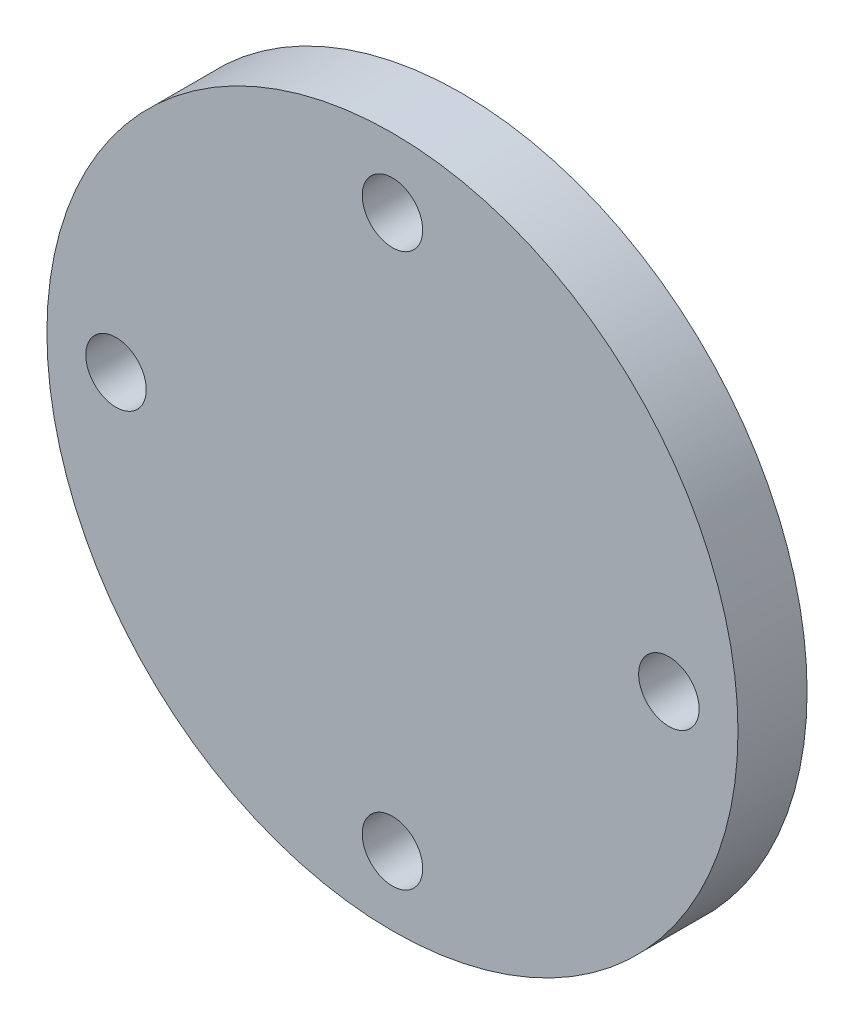
ISO-10303-21;
HEADER;
FILE_DESCRIPTION(('STEP AP214'),'2;1');
FILE_NAME('part.step','',(''),(''),'','','');
FILE_SCHEMA(('AUTOMOTIVE_DESIGN { 1 0 10303 214 1 1 1 1 }'));
ENDSEC;
DATA;
#1=APPLICATION_CONTEXT('core data for automotive mechanical design processes');
#2=APPLICATION_PROTOCOL_DEFINITION('international standard','automotive_design',2000,#1);
#3=PRODUCT_CONTEXT('',#1,'mechanical');
#4=PRODUCT('Part','Part','',(#3));
#5=PRODUCT_RELATED_PRODUCT_CATEGORY('part','',(#4));
#6=PRODUCT_DEFINITION_FORMATION('','',#4);
#7=PRODUCT_DEFINITION_CONTEXT('part definition',#1,'design');
#8=PRODUCT_DEFINITION('design','',#6,#7);
#9=PRODUCT_DEFINITION_SHAPE('','',#8);
#10=(LENGTH_UNIT() NAMED_UNIT(*) SI_UNIT(.MILLI.,.METRE.));
#11=(NAMED_UNIT(*) PLANE_ANGLE_UNIT() SI_UNIT($,.RADIAN.));
#12=(NAMED_UNIT(*) SI_UNIT($,.STERADIAN.) SOLID_ANGLE_UNIT());
#13=UNCERTAINTY_MEASURE_WITH_UNIT(LENGTH_MEASURE(1.E-05),#10,'distance_accuracy_value','');
#14=(GEOMETRIC_REPRESENTATION_CONTEXT(3) GLOBAL_UNCERTAINTY_ASSIGNED_CONTEXT((#13)) GLOBAL_UNIT_ASSIGNED_CONTEXT((#10,
#11,#12)) REPRESENTATION_CONTEXT('',''));
#15=CARTESIAN_POINT('',(0.,0.,0.));
#16=DIRECTION('',(0.,0.,1.));
#17=DIRECTION('',(1.,0.,0.));
#18=AXIS2_PLACEMENT_3D('',#15,#16,#17);
#19=CARTESIAN_POINT('',(0.,0.,0.));
#20=DIRECTION('',(0.,0.,1.));
#21=DIRECTION('',(1.,0.,0.));
#22=AXIS2_PLACEMENT_3D('',#19,#20,#21);
#23=PLANE('',#22);
#24=CARTESIAN_POINT('',(0.,0.,0.));
#25=DIRECTION('',(0.,0.,1.));
#26=DIRECTION('',(1.,0.,0.));
#27=AXIS2_PLACEMENT_3D('',#24,#25,#26);
#28=CIRCLE('',#27,63.5);
#29=CARTESIAN_POINT('',(63.5,0.,0.));
#30=VERTEX_POINT('',#29);
#31=EDGE_CURVE('E52',#30,#30,#28,.T.);
#32=ORIENTED_EDGE('',*,*,#31,.F.);
#33=EDGE_LOOP('',(#32));
#34=FACE_BOUND('',#33,.T.);
#35=CARTESIAN_POINT('',(-50.8,0.,0.));
#36=DIRECTION('',(0.,0.,1.));
#37=DIRECTION('',(1.,0.,0.));
#38=AXIS2_PLACEMENT_3D('',#35,#36,#37);
#39=CIRCLE('',#38,5.55625);
#40=CARTESIAN_POINT('',(-45.24375,0.,0.));
#41=VERTEX_POINT('',#40);
#42=EDGE_CURVE('E146',#41,#41,#39,.T.);
#43=ORIENTED_EDGE('',*,*,#42,.T.);
#44=EDGE_LOOP('',(#43));
#45=FACE_BOUND('',#44,.T.);
#46=CARTESIAN_POINT('',(1.80411241501588E-13,50.8,0.));
#47=DIRECTION('',(0.,0.,1.));
#48=DIRECTION('',(1.,0.,0.));
#49=AXIS2_PLACEMENT_3D('',#46,#47,#48);
#50=CIRCLE('',#49,5.55625);
#51=CARTESIAN_POINT('',(5.55625000000018,50.8,0.));
#52=VERTEX_POINT('',#51);
#53=EDGE_CURVE('E140',#52,#52,#50,.T.);
#54=ORIENTED_EDGE('',*,*,#53,.T.);
#55=EDGE_LOOP('',(#54));
#56=FACE_BOUND('',#55,.T.);
#57=CARTESIAN_POINT('',(50.8,-3.60822483003176E-13,0.));
#58=DIRECTION('',(0.,0.,1.));
#59=DIRECTION('',(1.,0.,0.));
#60=AXIS2_PLACEMENT_3D('',#57,#58,#59);
#61=CIRCLE('',#60,5.55625);
#62=CARTESIAN_POINT('',(56.35625,-3.60822483003176E-13,0.));
#63=VERTEX_POINT('',#62);
#64=EDGE_CURVE('E134',#63,#63,#61,.T.);
#65=ORIENTED_EDGE('',*,*,#64,.T.);
#66=EDGE_LOOP('',(#65));
#67=FACE_BOUND('',#66,.T.);
#68=CARTESIAN_POINT('',(-5.34294830600857E-13,-50.8,0.));
#69=DIRECTION('',(0.,0.,1.));
#70=DIRECTION('',(1.,0.,0.));
#71=AXIS2_PLACEMENT_3D('',#68,#69,#70);
#72=CIRCLE('',#71,5.55624999999999);
#73=CARTESIAN_POINT('',(5.55624999999946,-50.8,0.));
#74=VERTEX_POINT('',#73);
#75=EDGE_CURVE('E129',#74,#74,#72,.T.);
#76=ORIENTED_EDGE('',*,*,#75,.T.);
#77=EDGE_LOOP('',(#76));
#78=FACE_BOUND('',#77,.T.);
#79=CARTESIAN_POINT('',(0.,0.,0.));
#80=DIRECTION('',(0.,0.,-1.));
#81=DIRECTION('',(-1.,0.,0.));
#82=AXIS2_PLACEMENT_3D('',#79,#80,#81);
#83=CIRCLE('',#82,12.7);
#84=CARTESIAN_POINT('',(-12.7,0.,0.));
#85=VERTEX_POINT('',#84);
#86=EDGE_CURVE('E13',#85,#85,#83,.T.);
#87=ORIENTED_EDGE('',*,*,#86,.F.);
#88=EDGE_LOOP('',(#87));
#89=FACE_BOUND('',#88,.T.);
#90=ADVANCED_FACE('F48',(#34,#45,#56,#67,#78,#89),#23,.F.);
#91=CARTESIAN_POINT('',(0.,0.,12.7));
#92=DIRECTION('',(0.,0.,1.));
#93=DIRECTION('',(1.,0.,0.));
#94=AXIS2_PLACEMENT_3D('',#91,#92,#93);
#95=PLANE('',#94);
#96=CARTESIAN_POINT('',(50.8,-3.60822483003176E-13,12.7));
#97=DIRECTION('',(0.,0.,1.));
#98=DIRECTION('',(1.,0.,0.));
#99=AXIS2_PLACEMENT_3D('',#96,#97,#98);
#100=CIRCLE('',#99,5.55625);
#101=CARTESIAN_POINT('',(56.35625,-3.60822483003176E-13,12.7));
#102=VERTEX_POINT('',#101);
#103=EDGE_CURVE('E137',#102,#102,#100,.T.);
#104=ORIENTED_EDGE('',*,*,#103,.F.);
#105=EDGE_LOOP('',(#104));
#106=FACE_BOUND('',#105,.T.);
#107=CARTESIAN_POINT('',(-50.8,0.,12.7));
#108=DIRECTION('',(0.,0.,1.));
#109=DIRECTION('',(1.,0.,0.));
#110=AXIS2_PLACEMENT_3D('',#107,#108,#109);
#111=CIRCLE('',#110,5.55625);
#112=CARTESIAN_POINT('',(-45.24375,0.,12.7));
#113=VERTEX_POINT('',#112);
#114=EDGE_CURVE('E149',#113,#113,#111,.T.);
#115=ORIENTED_EDGE('',*,*,#114,.F.);
#116=EDGE_LOOP('',(#115));
#117=FACE_BOUND('',#116,.T.);
#118=CARTESIAN_POINT('',(0.,0.,12.7));
#119=DIRECTION('',(0.,0.,1.));
#120=DIRECTION('',(1.,0.,0.));
#121=AXIS2_PLACEMENT_3D('',#118,#119,#120);
#122=CIRCLE('',#121,63.5);
#123=CARTESIAN_POINT('',(63.5,0.,12.7));
#124=VERTEX_POINT('',#123);
#125=EDGE_CURVE('E57',#124,#124,#122,.T.);
#126=ORIENTED_EDGE('',*,*,#125,.T.);
#127=EDGE_LOOP('',(#126));
#128=FACE_BOUND('',#127,.T.);
#129=CARTESIAN_POINT('',(1.80411241501588E-13,50.8,12.7));
#130=DIRECTION('',(0.,0.,1.));
#131=DIRECTION('',(1.,0.,0.));
#132=AXIS2_PLACEMENT_3D('',#129,#130,#131);
#133=CIRCLE('',#132,5.55625);
#134=CARTESIAN_POINT('',(5.55625000000018,50.8,12.7));
#135=VERTEX_POINT('',#134);
#136=EDGE_CURVE('E143',#135,#135,#133,.T.);
#137=ORIENTED_EDGE('',*,*,#136,.F.);
#138=EDGE_LOOP('',(#137));
#139=FACE_BOUND('',#138,.T.);
#140=CARTESIAN_POINT('',(-5.34294830600857E-13,-50.8,12.7));
#141=DIRECTION('',(0.,0.,1.));
#142=DIRECTION('',(1.,0.,0.));
#143=AXIS2_PLACEMENT_3D('',#140,#141,#142);
#144=CIRCLE('',#143,5.55624999999999);
#145=CARTESIAN_POINT('',(5.55624999999946,-50.8,12.7));
#146=VERTEX_POINT('',#145);
#147=EDGE_CURVE('E131',#146,#146,#144,.T.);
#148=ORIENTED_EDGE('',*,*,#147,.F.);
#149=EDGE_LOOP('',(#148));
#150=FACE_BOUND('',#149,.T.);
#151=ADVANCED_FACE('F162',(#106,#117,#128,#139,#150),#95,.T.);
#152=CARTESIAN_POINT('',(0.,0.,12.7));
#153=DIRECTION('',(0.,0.,-1.));
#154=DIRECTION('',(-1.,0.,0.));
#155=AXIS2_PLACEMENT_3D('',#152,#153,#154);
#156=CYLINDRICAL_SURFACE('',#155,63.5);
#157=ORIENTED_EDGE('',*,*,#125,.F.);
#158=EDGE_LOOP('',(#157));
#159=FACE_BOUND('',#158,.T.);
#160=ORIENTED_EDGE('',*,*,#31,.T.);
#161=EDGE_LOOP('',(#160));
#162=FACE_BOUND('',#161,.T.);
#163=ADVANCED_FACE('F50',(#159,#162),#156,.T.);
#164=CARTESIAN_POINT('',(-50.8,0.,12.7));
#165=DIRECTION('',(0.,0.,-1.));
#166=DIRECTION('',(-1.,0.,0.));
#167=AXIS2_PLACEMENT_3D('',#164,#165,#166);
#168=CYLINDRICAL_SURFACE('',#167,5.55625);
#169=ORIENTED_EDGE('',*,*,#114,.T.);
#170=EDGE_LOOP('',(#169));
#171=FACE_BOUND('',#170,.T.);
#172=ORIENTED_EDGE('',*,*,#42,.F.);
#173=EDGE_LOOP('',(#172));
#174=FACE_BOUND('',#173,.T.);
#175=ADVANCED_FACE('F198',(#171,#174),#168,.F.);
#176=CARTESIAN_POINT('',(1.80411241501588E-13,50.8,12.7));
#177=DIRECTION('',(0.,0.,-1.));
#178=DIRECTION('',(-1.,0.,0.));
#179=AXIS2_PLACEMENT_3D('',#176,#177,#178);
#180=CYLINDRICAL_SURFACE('',#179,5.55625);
#181=ORIENTED_EDGE('',*,*,#136,.T.);
#182=EDGE_LOOP('',(#181));
#183=FACE_BOUND('',#182,.T.);
#184=ORIENTED_EDGE('',*,*,#53,.F.);
#185=EDGE_LOOP('',(#184));
#186=FACE_BOUND('',#185,.T.);
#187=ADVANCED_FACE('F194',(#183,#186),#180,.F.);
#188=CARTESIAN_POINT('',(50.8,-3.60822483003176E-13,12.7));
#189=DIRECTION('',(0.,0.,-1.));
#190=DIRECTION('',(-1.,0.,0.));
#191=AXIS2_PLACEMENT_3D('',#188,#189,#190);
#192=CYLINDRICAL_SURFACE('',#191,5.55625);
#193=ORIENTED_EDGE('',*,*,#103,.T.);
#194=EDGE_LOOP('',(#193));
#195=FACE_BOUND('',#194,.T.);
#196=ORIENTED_EDGE('',*,*,#64,.F.);
#197=EDGE_LOOP('',(#196));
#198=FACE_BOUND('',#197,.T.);
#199=ADVANCED_FACE('F190',(#195,#198),#192,.F.);
#200=CARTESIAN_POINT('',(-5.34294830600857E-13,-50.8,12.7));
#201=DIRECTION('',(0.,0.,-1.));
#202=DIRECTION('',(-1.,0.,0.));
#203=AXIS2_PLACEMENT_3D('',#200,#201,#202);
#204=CYLINDRICAL_SURFACE('',#203,5.55624999999999);
#205=ORIENTED_EDGE('',*,*,#147,.T.);
#206=EDGE_LOOP('',(#205));
#207=FACE_BOUND('',#206,.T.);
#208=ORIENTED_EDGE('',*,*,#75,.F.);
#209=EDGE_LOOP('',(#208));
#210=FACE_BOUND('',#209,.T.);
#211=ADVANCED_FACE('F183',(#207,#210),#204,.F.);
#212=CARTESIAN_POINT('',(0.,0.,-35.56));
#213=DIRECTION('',(0.,0.,-1.));
#214=DIRECTION('',(-1.,0.,0.));
#215=AXIS2_PLACEMENT_3D('',#212,#213,#214);
#216=PLANE('',#215);
#217=CARTESIAN_POINT('',(0.,0.,-35.56));
#218=DIRECTION('',(0.,0.,-1.));
#219=DIRECTION('',(-1.,0.,0.));
#220=AXIS2_PLACEMENT_3D('',#217,#218,#219);
#221=CIRCLE('',#220,12.7);
#222=CARTESIAN_POINT('',(-12.7,0.,-35.56));
#223=VERTEX_POINT('',#222);
#224=EDGE_CURVE('E106',#223,#223,#221,.T.);
#225=ORIENTED_EDGE('',*,*,#224,.T.);
#226=EDGE_LOOP('',(#225));
#227=FACE_BOUND('',#226,.T.);
#228=DIRECTION('',(0.,-1.,0.));
#229=VECTOR('',#228,1.);
#230=CARTESIAN_POINT('',(-2.3876,5.06380150187874,-35.56));
#231=LINE('',#230,#229);
#232=CARTESIAN_POINT('',(-2.3876,7.56989250187873,-35.56));
#233=VERTEX_POINT('',#232);
#234=CARTESIAN_POINT('',(-2.3876,5.06380150187874,-35.56));
#235=VERTEX_POINT('',#234);
#236=EDGE_CURVE('E98',#233,#235,#231,.T.);
#237=ORIENTED_EDGE('',*,*,#236,.F.);
#238=CARTESIAN_POINT('',(0.,0.,-35.56));
#239=DIRECTION('',(0.,0.,-1.));
#240=DIRECTION('',(-1.,0.,0.));
#241=AXIS2_PLACEMENT_3D('',#238,#239,#240);
#242=CIRCLE('',#241,7.9375);
#243=CARTESIAN_POINT('',(2.3876,7.56989250187873,-35.56));
#244=VERTEX_POINT('',#243);
#245=EDGE_CURVE('E90',#244,#233,#242,.T.);
#246=ORIENTED_EDGE('',*,*,#245,.F.);
#247=DIRECTION('',(0.,1.,0.));
#248=VECTOR('',#247,1.);
#249=CARTESIAN_POINT('',(2.3876,7.56989250187873,-35.56));
#250=LINE('',#249,#248);
#251=CARTESIAN_POINT('',(2.3876,5.06380150187874,-35.56));
#252=VERTEX_POINT('',#251);
#253=EDGE_CURVE('E113',#252,#244,#250,.T.);
#254=ORIENTED_EDGE('',*,*,#253,.F.);
#255=DIRECTION('',(1.,0.,0.));
#256=VECTOR('',#255,1.);
#257=CARTESIAN_POINT('',(2.3876,5.06380150187874,-35.56));
#258=LINE('',#257,#256);
#259=EDGE_CURVE('E111',#235,#252,#258,.T.);
#260=ORIENTED_EDGE('',*,*,#259,.F.);
#261=EDGE_LOOP('',(#237,#246,#254,#260));
#262=FACE_BOUND('',#261,.T.);
#263=ADVANCED_FACE('F110',(#227,#262),#216,.T.);
#264=CARTESIAN_POINT('',(0.,0.,-35.56));
#265=DIRECTION('',(0.,0.,1.));
#266=DIRECTION('',(1.,0.,0.));
#267=AXIS2_PLACEMENT_3D('',#264,#265,#266);
#268=CYLINDRICAL_SURFACE('',#267,12.7);
#269=ORIENTED_EDGE('',*,*,#224,.F.);
#270=EDGE_LOOP('',(#269));
#271=FACE_BOUND('',#270,.T.);
#272=ORIENTED_EDGE('',*,*,#86,.T.);
#273=EDGE_LOOP('',(#272));
#274=FACE_BOUND('',#273,.T.);
#275=ADVANCED_FACE('F174',(#271,#274),#268,.T.);
#276=CARTESIAN_POINT('',(0.,0.,-35.56));
#277=DIRECTION('',(0.,0.,1.));
#278=DIRECTION('',(1.,0.,0.));
#279=AXIS2_PLACEMENT_3D('',#276,#277,#278);
#280=CYLINDRICAL_SURFACE('',#279,7.9375);
#281=CARTESIAN_POINT('',(0.,0.,0.));
#282=DIRECTION('',(0.,0.,-1.));
#283=DIRECTION('',(-1.,0.,0.));
#284=AXIS2_PLACEMENT_3D('',#281,#282,#283);
#285=CIRCLE('',#284,7.9375);
#286=CARTESIAN_POINT('',(2.3876,7.56989250187873,0.));
#287=VERTEX_POINT('',#286);
#288=CARTESIAN_POINT('',(-2.3876,7.56989250187873,0.));
#289=VERTEX_POINT('',#288);
#290=EDGE_CURVE('E117',#287,#289,#285,.T.);
#291=ORIENTED_EDGE('',*,*,#290,.F.);
#292=DIRECTION('',(0.,0.,1.));
#293=VECTOR('',#292,1.);
#294=CARTESIAN_POINT('',(2.3876,7.56989250187873,-35.56));
#295=LINE('',#294,#293);
#296=EDGE_CURVE('E65',#244,#287,#295,.T.);
#297=ORIENTED_EDGE('',*,*,#296,.F.);
#298=ORIENTED_EDGE('',*,*,#245,.T.);
#299=DIRECTION('',(0.,0.,1.));
#300=VECTOR('',#299,1.);
#301=CARTESIAN_POINT('',(-2.3876,7.56989250187873,-35.56));
#302=LINE('',#301,#300);
#303=EDGE_CURVE('E93',#233,#289,#302,.T.);
#304=ORIENTED_EDGE('',*,*,#303,.T.);
#305=EDGE_LOOP('',(#291,#297,#298,#304));
#306=FACE_BOUND('',#305,.T.);
#307=ADVANCED_FACE('F92',(#306),#280,.F.);
#308=CARTESIAN_POINT('',(-2.3876,5.06380150187874,-35.56));
#309=DIRECTION('',(-1.,0.,0.));
#310=DIRECTION('',(0.,0.,1.));
#311=AXIS2_PLACEMENT_3D('',#308,#309,#310);
#312=PLANE('',#311);
#313=DIRECTION('',(0.,-1.,0.));
#314=VECTOR('',#313,1.);
#315=CARTESIAN_POINT('',(-2.3876,5.06380150187874,0.));
#316=LINE('',#315,#314);
#317=CARTESIAN_POINT('',(-2.3876,5.06380150187874,0.));
#318=VERTEX_POINT('',#317);
#319=EDGE_CURVE('E105',#289,#318,#316,.T.);
#320=ORIENTED_EDGE('',*,*,#319,.F.);
#321=ORIENTED_EDGE('',*,*,#303,.F.);
#322=ORIENTED_EDGE('',*,*,#236,.T.);
#323=DIRECTION('',(0.,0.,1.));
#324=VECTOR('',#323,1.);
#325=CARTESIAN_POINT('',(-2.3876,5.06380150187874,-35.56));
#326=LINE('',#325,#324);
#327=EDGE_CURVE('E107',#235,#318,#326,.T.);
#328=ORIENTED_EDGE('',*,*,#327,.T.);
#329=EDGE_LOOP('',(#320,#321,#322,#328));
#330=FACE_BOUND('',#329,.T.);
#331=ADVANCED_FACE('F102',(#330),#312,.T.);
#332=CARTESIAN_POINT('',(2.3876,5.06380150187874,-35.56));
#333=DIRECTION('',(0.,-1.,0.));
#334=DIRECTION('',(0.,0.,-1.));
#335=AXIS2_PLACEMENT_3D('',#332,#333,#334);
#336=PLANE('',#335);
#337=DIRECTION('',(1.,0.,0.));
#338=VECTOR('',#337,1.);
#339=CARTESIAN_POINT('',(2.3876,5.06380150187874,0.));
#340=LINE('',#339,#338);
#341=CARTESIAN_POINT('',(2.3876,5.06380150187874,0.));
#342=VERTEX_POINT('',#341);
#343=EDGE_CURVE('E120',#318,#342,#340,.T.);
#344=ORIENTED_EDGE('',*,*,#343,.F.);
#345=ORIENTED_EDGE('',*,*,#327,.F.);
#346=ORIENTED_EDGE('',*,*,#259,.T.);
#347=DIRECTION('',(0.,0.,1.));
#348=VECTOR('',#347,1.);
#349=CARTESIAN_POINT('',(2.3876,5.06380150187874,-35.56));
#350=LINE('',#349,#348);
#351=EDGE_CURVE('E70',#252,#342,#350,.T.);
#352=ORIENTED_EDGE('',*,*,#351,.T.);
#353=EDGE_LOOP('',(#344,#345,#346,#352));
#354=FACE_BOUND('',#353,.T.);
#355=ADVANCED_FACE('F211',(#354),#336,.T.);
#356=CARTESIAN_POINT('',(2.3876,7.56989250187873,-35.56));
#357=DIRECTION('',(1.,0.,0.));
#358=DIRECTION('',(0.,0.,-1.));
#359=AXIS2_PLACEMENT_3D('',#356,#357,#358);
#360=PLANE('',#359);
#361=DIRECTION('',(0.,1.,0.));
#362=VECTOR('',#361,1.);
#363=CARTESIAN_POINT('',(2.3876,7.56989250187873,0.));
#364=LINE('',#363,#362);
#365=EDGE_CURVE('E99',#342,#287,#364,.T.);
#366=ORIENTED_EDGE('',*,*,#365,.F.);
#367=ORIENTED_EDGE('',*,*,#351,.F.);
#368=ORIENTED_EDGE('',*,*,#253,.T.);
#369=ORIENTED_EDGE('',*,*,#296,.T.);
#370=EDGE_LOOP('',(#366,#367,#368,#369));
#371=FACE_BOUND('',#370,.T.);
#372=ADVANCED_FACE('F206',(#371),#360,.T.);
#373=ORIENTED_EDGE('',*,*,#365,.T.);
#374=ORIENTED_EDGE('',*,*,#290,.T.);
#375=ORIENTED_EDGE('',*,*,#319,.T.);
#376=ORIENTED_EDGE('',*,*,#343,.T.);
#377=EDGE_LOOP('',(#373,#374,#375,#376));
#378=FACE_BOUND('',#377,.T.);
#379=ADVANCED_FACE('F163',(#378),#23,.F.);
#380=CLOSED_SHELL('',(#90,#151,#163,#175,#187,#199,#211,#263,#275,#307,#331,#355,#372,#379));
#381=MANIFOLD_SOLID_BREP('B2',#380);
#382=ADVANCED_BREP_SHAPE_REPRESENTATION('',(#18,#381),#14);
#383=SHAPE_DEFINITION_REPRESENTATION(#9,#382);
ENDSEC;
END-ISO-10303-21;
